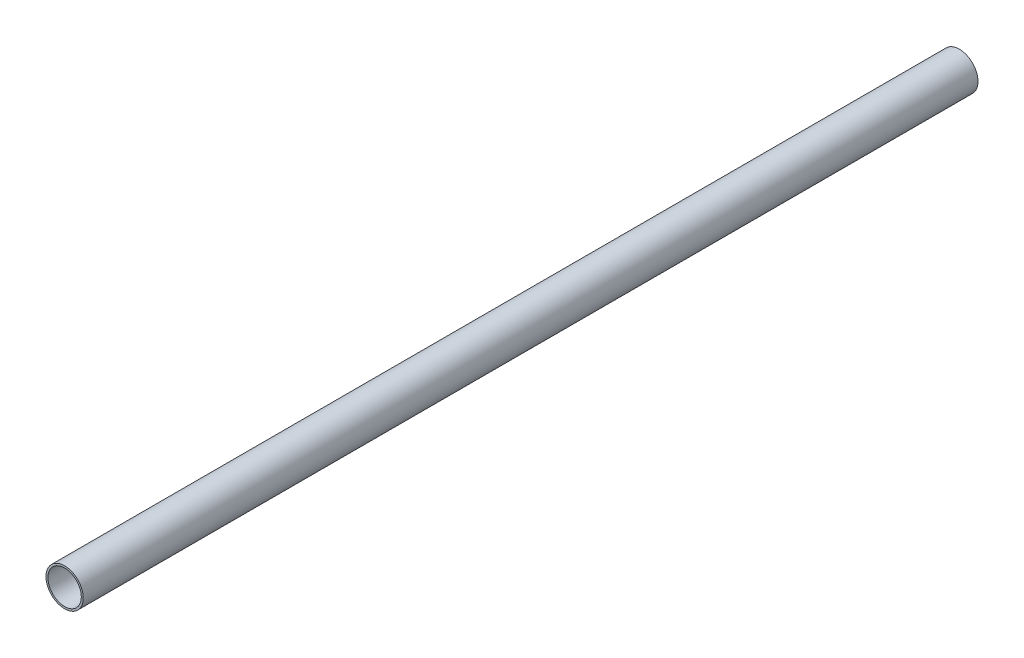
ISO-10303-21;
HEADER;
FILE_DESCRIPTION(('STEP AP214'),'2;1');
FILE_NAME('part.step','',(''),(''),'','','');
FILE_SCHEMA(('AUTOMOTIVE_DESIGN { 1 0 10303 214 1 1 1 1 }'));
ENDSEC;
DATA;
#1=APPLICATION_CONTEXT('core data for automotive mechanical design processes');
#2=APPLICATION_PROTOCOL_DEFINITION('international standard','automotive_design',2000,#1);
#3=PRODUCT_CONTEXT('',#1,'mechanical');
#4=PRODUCT('Part','Part','',(#3));
#5=PRODUCT_RELATED_PRODUCT_CATEGORY('part','',(#4));
#6=PRODUCT_DEFINITION_FORMATION('','',#4);
#7=PRODUCT_DEFINITION_CONTEXT('part definition',#1,'design');
#8=PRODUCT_DEFINITION('design','',#6,#7);
#9=PRODUCT_DEFINITION_SHAPE('','',#8);
#10=(LENGTH_UNIT() NAMED_UNIT(*) SI_UNIT(.MILLI.,.METRE.));
#11=(NAMED_UNIT(*) PLANE_ANGLE_UNIT() SI_UNIT($,.RADIAN.));
#12=(NAMED_UNIT(*) SI_UNIT($,.STERADIAN.) SOLID_ANGLE_UNIT());
#13=UNCERTAINTY_MEASURE_WITH_UNIT(LENGTH_MEASURE(1.E-05),#10,'distance_accuracy_value','');
#14=(GEOMETRIC_REPRESENTATION_CONTEXT(3) GLOBAL_UNCERTAINTY_ASSIGNED_CONTEXT((#13)) GLOBAL_UNIT_ASSIGNED_CONTEXT((#10,
#11,#12)) REPRESENTATION_CONTEXT('',''));
#15=CARTESIAN_POINT('',(0.,0.,0.));
#16=DIRECTION('',(0.,0.,1.));
#17=DIRECTION('',(1.,0.,0.));
#18=AXIS2_PLACEMENT_3D('',#15,#16,#17);
#19=CARTESIAN_POINT('',(0.,0.,0.));
#20=DIRECTION('',(0.,0.,1.));
#21=DIRECTION('',(1.,0.,0.));
#22=AXIS2_PLACEMENT_3D('',#19,#20,#21);
#23=CYLINDRICAL_SURFACE('',#22,14.224);
#24=CARTESIAN_POINT('',(0.,0.,0.));
#25=DIRECTION('',(0.,0.,1.));
#26=DIRECTION('',(1.,0.,0.));
#27=AXIS2_PLACEMENT_3D('',#24,#25,#26);
#28=CIRCLE('',#27,14.224);
#29=CARTESIAN_POINT('',(14.224,0.,0.));
#30=VERTEX_POINT('',#29);
#31=EDGE_CURVE('E25',#30,#30,#28,.F.);
#32=ORIENTED_EDGE('',*,*,#31,.T.);
#33=EDGE_LOOP('',(#32));
#34=FACE_BOUND('',#33,.T.);
#35=CARTESIAN_POINT('',(0.,0.,762.));
#36=DIRECTION('',(0.,0.,1.));
#37=DIRECTION('',(1.,0.,0.));
#38=AXIS2_PLACEMENT_3D('',#35,#36,#37);
#39=CIRCLE('',#38,14.224);
#40=CARTESIAN_POINT('',(14.224,0.,762.));
#41=VERTEX_POINT('',#40);
#42=EDGE_CURVE('E16',#41,#41,#39,.F.);
#43=ORIENTED_EDGE('',*,*,#42,.F.);
#44=EDGE_LOOP('',(#43));
#45=FACE_BOUND('',#44,.T.);
#46=ADVANCED_FACE('F13',(#34,#45),#23,.F.);
#47=CARTESIAN_POINT('',(0.,0.,762.));
#48=DIRECTION('',(0.,0.,1.));
#49=DIRECTION('',(1.,0.,0.));
#50=AXIS2_PLACEMENT_3D('',#47,#48,#49);
#51=PLANE('',#50);
#52=ORIENTED_EDGE('',*,*,#42,.T.);
#53=EDGE_LOOP('',(#52));
#54=FACE_BOUND('',#53,.T.);
#55=CARTESIAN_POINT('',(0.,0.,762.));
#56=DIRECTION('',(0.,0.,1.));
#57=DIRECTION('',(1.,0.,0.));
#58=AXIS2_PLACEMENT_3D('',#55,#56,#57);
#59=CIRCLE('',#58,15.875);
#60=CARTESIAN_POINT('',(15.875,0.,762.));
#61=VERTEX_POINT('',#60);
#62=EDGE_CURVE('E20',#61,#61,#59,.F.);
#63=ORIENTED_EDGE('',*,*,#62,.F.);
#64=EDGE_LOOP('',(#63));
#65=FACE_BOUND('',#64,.T.);
#66=ADVANCED_FACE('F33',(#54,#65),#51,.T.);
#67=CARTESIAN_POINT('',(0.,0.,0.));
#68=DIRECTION('',(0.,0.,1.));
#69=DIRECTION('',(1.,0.,0.));
#70=AXIS2_PLACEMENT_3D('',#67,#68,#69);
#71=PLANE('',#70);
#72=ORIENTED_EDGE('',*,*,#31,.F.);
#73=EDGE_LOOP('',(#72));
#74=FACE_BOUND('',#73,.T.);
#75=CARTESIAN_POINT('',(0.,0.,0.));
#76=DIRECTION('',(0.,0.,1.));
#77=DIRECTION('',(1.,0.,0.));
#78=AXIS2_PLACEMENT_3D('',#75,#76,#77);
#79=CIRCLE('',#78,15.875);
#80=CARTESIAN_POINT('',(15.875,0.,0.));
#81=VERTEX_POINT('',#80);
#82=EDGE_CURVE('E8',#81,#81,#79,.T.);
#83=ORIENTED_EDGE('',*,*,#82,.F.);
#84=EDGE_LOOP('',(#83));
#85=FACE_BOUND('',#84,.T.);
#86=ADVANCED_FACE('F41',(#74,#85),#71,.F.);
#87=CARTESIAN_POINT('',(0.,0.,0.));
#88=DIRECTION('',(0.,0.,1.));
#89=DIRECTION('',(1.,0.,0.));
#90=AXIS2_PLACEMENT_3D('',#87,#88,#89);
#91=CYLINDRICAL_SURFACE('',#90,15.875);
#92=ORIENTED_EDGE('',*,*,#82,.T.);
#93=EDGE_LOOP('',(#92));
#94=FACE_BOUND('',#93,.T.);
#95=ORIENTED_EDGE('',*,*,#62,.T.);
#96=EDGE_LOOP('',(#95));
#97=FACE_BOUND('',#96,.T.);
#98=ADVANCED_FACE('F42',(#94,#97),#91,.T.);
#99=CLOSED_SHELL('',(#46,#66,#86,#98));
#100=MANIFOLD_SOLID_BREP('B1',#99);
#101=ADVANCED_BREP_SHAPE_REPRESENTATION('',(#18,#100),#14);
#102=SHAPE_DEFINITION_REPRESENTATION(#9,#101);
ENDSEC;
END-ISO-10303-21;
